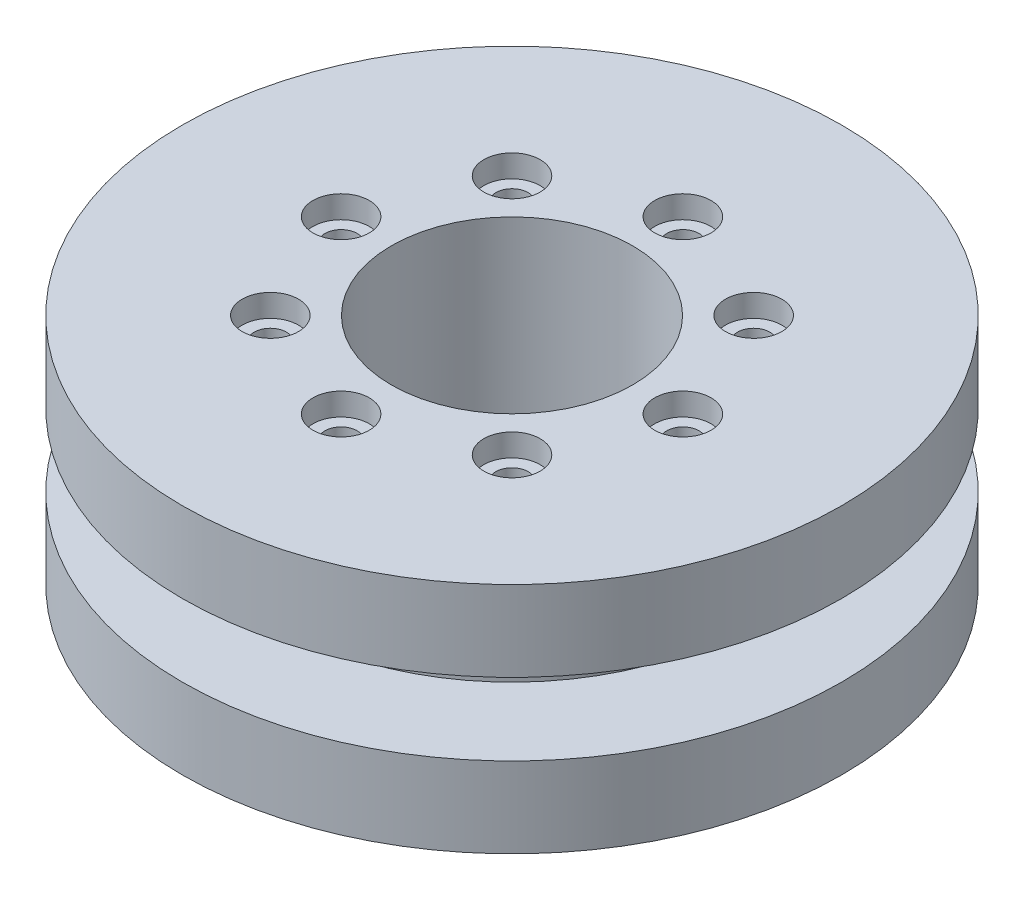
ISO-10303-21;
HEADER;
FILE_DESCRIPTION(('STEP AP214'),'2;1');
FILE_NAME('part.step','',(''),(''),'','','');
FILE_SCHEMA(('AUTOMOTIVE_DESIGN { 1 0 10303 214 1 1 1 1 }'));
ENDSEC;
DATA;
#1=APPLICATION_CONTEXT('core data for automotive mechanical design processes');
#2=APPLICATION_PROTOCOL_DEFINITION('international standard','automotive_design',2000,#1);
#3=PRODUCT_CONTEXT('',#1,'mechanical');
#4=PRODUCT('Part','Part','',(#3));
#5=PRODUCT_RELATED_PRODUCT_CATEGORY('part','',(#4));
#6=PRODUCT_DEFINITION_FORMATION('','',#4);
#7=PRODUCT_DEFINITION_CONTEXT('part definition',#1,'design');
#8=PRODUCT_DEFINITION('design','',#6,#7);
#9=PRODUCT_DEFINITION_SHAPE('','',#8);
#10=(LENGTH_UNIT() NAMED_UNIT(*) SI_UNIT(.MILLI.,.METRE.));
#11=(NAMED_UNIT(*) PLANE_ANGLE_UNIT() SI_UNIT($,.RADIAN.));
#12=(NAMED_UNIT(*) SI_UNIT($,.STERADIAN.) SOLID_ANGLE_UNIT());
#13=UNCERTAINTY_MEASURE_WITH_UNIT(LENGTH_MEASURE(1.E-05),#10,'distance_accuracy_value','');
#14=(GEOMETRIC_REPRESENTATION_CONTEXT(3) GLOBAL_UNCERTAINTY_ASSIGNED_CONTEXT((#13)) GLOBAL_UNIT_ASSIGNED_CONTEXT((#10,
#11,#12)) REPRESENTATION_CONTEXT('',''));
#15=CARTESIAN_POINT('',(0.,0.,0.));
#16=DIRECTION('',(0.,0.,1.));
#17=DIRECTION('',(1.,0.,0.));
#18=AXIS2_PLACEMENT_3D('',#15,#16,#17);
#19=CARTESIAN_POINT('',(0.,14.5,0.));
#20=DIRECTION('',(0.,-1.,0.));
#21=DIRECTION('',(0.,0.,-1.));
#22=AXIS2_PLACEMENT_3D('',#19,#20,#21);
#23=CYLINDRICAL_SURFACE('',#22,41.);
#24=CARTESIAN_POINT('',(0.,14.5,0.));
#25=DIRECTION('',(0.,1.,0.));
#26=DIRECTION('',(0.,0.,1.));
#27=AXIS2_PLACEMENT_3D('',#24,#25,#26);
#28=CIRCLE('',#27,41.);
#29=CARTESIAN_POINT('',(0.,14.5,41.));
#30=VERTEX_POINT('',#29);
#31=EDGE_CURVE('E10',#30,#30,#28,.T.);
#32=ORIENTED_EDGE('',*,*,#31,.F.);
#33=EDGE_LOOP('',(#32));
#34=FACE_BOUND('',#33,.T.);
#35=CARTESIAN_POINT('',(0.,4.5,0.));
#36=DIRECTION('',(0.,1.,0.));
#37=DIRECTION('',(0.,0.,1.));
#38=AXIS2_PLACEMENT_3D('',#35,#36,#37);
#39=CIRCLE('',#38,41.);
#40=CARTESIAN_POINT('',(0.,4.5,41.));
#41=VERTEX_POINT('',#40);
#42=EDGE_CURVE('E59',#41,#41,#39,.T.);
#43=ORIENTED_EDGE('',*,*,#42,.T.);
#44=EDGE_LOOP('',(#43));
#45=FACE_BOUND('',#44,.T.);
#46=ADVANCED_FACE('F32',(#34,#45),#23,.T.);
#47=CARTESIAN_POINT('',(0.,14.5,0.));
#48=DIRECTION('',(0.,1.,0.));
#49=DIRECTION('',(0.,0.,1.));
#50=AXIS2_PLACEMENT_3D('',#47,#48,#49);
#51=PLANE('',#50);
#52=CARTESIAN_POINT('',(-15.026019100214,14.5,-15.0260191002143));
#53=DIRECTION('',(0.,1.,0.));
#54=DIRECTION('',(0.,0.,1.));
#55=AXIS2_PLACEMENT_3D('',#52,#53,#54);
#56=CIRCLE('',#55,3.50000000000001);
#57=CARTESIAN_POINT('',(-15.026019100214,14.5,-11.5260191002143));
#58=VERTEX_POINT('',#57);
#59=EDGE_CURVE('E155',#58,#58,#56,.T.);
#60=ORIENTED_EDGE('',*,*,#59,.F.);
#61=EDGE_LOOP('',(#60));
#62=FACE_BOUND('',#61,.T.);
#63=CARTESIAN_POINT('',(-21.25,14.5,-2.2258193535125E-13));
#64=DIRECTION('',(0.,1.,0.));
#65=DIRECTION('',(0.,0.,1.));
#66=AXIS2_PLACEMENT_3D('',#63,#64,#65);
#67=CIRCLE('',#66,3.50000000000001);
#68=CARTESIAN_POINT('',(-21.25,14.5,3.49999999999979));
#69=VERTEX_POINT('',#68);
#70=EDGE_CURVE('E143',#69,#69,#67,.T.);
#71=ORIENTED_EDGE('',*,*,#70,.F.);
#72=EDGE_LOOP('',(#71));
#73=FACE_BOUND('',#72,.T.);
#74=CARTESIAN_POINT('',(-15.0260191002143,14.5,15.026019100214));
#75=DIRECTION('',(0.,1.,0.));
#76=DIRECTION('',(0.,0.,1.));
#77=AXIS2_PLACEMENT_3D('',#74,#75,#76);
#78=CIRCLE('',#77,3.50000000000001);
#79=CARTESIAN_POINT('',(-15.0260191002143,14.5,18.526019100214));
#80=VERTEX_POINT('',#79);
#81=EDGE_CURVE('E131',#80,#80,#78,.T.);
#82=ORIENTED_EDGE('',*,*,#81,.F.);
#83=EDGE_LOOP('',(#82));
#84=FACE_BOUND('',#83,.T.);
#85=CARTESIAN_POINT('',(0.,14.5,21.25));
#86=DIRECTION('',(0.,1.,0.));
#87=DIRECTION('',(0.,0.,1.));
#88=AXIS2_PLACEMENT_3D('',#85,#86,#87);
#89=CIRCLE('',#88,3.50000000000001);
#90=CARTESIAN_POINT('',(0.,14.5,24.75));
#91=VERTEX_POINT('',#90);
#92=EDGE_CURVE('E119',#91,#91,#89,.T.);
#93=ORIENTED_EDGE('',*,*,#92,.F.);
#94=EDGE_LOOP('',(#93));
#95=FACE_BOUND('',#94,.T.);
#96=CARTESIAN_POINT('',(15.0260191002141,14.5,15.0260191002142));
#97=DIRECTION('',(0.,1.,0.));
#98=DIRECTION('',(0.,0.,1.));
#99=AXIS2_PLACEMENT_3D('',#96,#97,#98);
#100=CIRCLE('',#99,3.50000000000001);
#101=CARTESIAN_POINT('',(15.0260191002141,14.5,18.5260191002142));
#102=VERTEX_POINT('',#101);
#103=EDGE_CURVE('E107',#102,#102,#100,.T.);
#104=ORIENTED_EDGE('',*,*,#103,.F.);
#105=EDGE_LOOP('',(#104));
#106=FACE_BOUND('',#105,.T.);
#107=CARTESIAN_POINT('',(21.25,14.5,0.));
#108=DIRECTION('',(0.,1.,0.));
#109=DIRECTION('',(0.,0.,1.));
#110=AXIS2_PLACEMENT_3D('',#107,#108,#109);
#111=CIRCLE('',#110,3.50000000000001);
#112=CARTESIAN_POINT('',(21.25,14.5,3.50000000000009));
#113=VERTEX_POINT('',#112);
#114=EDGE_CURVE('E95',#113,#113,#111,.T.);
#115=ORIENTED_EDGE('',*,*,#114,.F.);
#116=EDGE_LOOP('',(#115));
#117=FACE_BOUND('',#116,.T.);
#118=CARTESIAN_POINT('',(15.0260191002142,14.5,-15.0260191002141));
#119=DIRECTION('',(0.,1.,0.));
#120=DIRECTION('',(0.,0.,1.));
#121=AXIS2_PLACEMENT_3D('',#118,#119,#120);
#122=CIRCLE('',#121,3.50000000000001);
#123=CARTESIAN_POINT('',(15.0260191002142,14.5,-11.5260191002141));
#124=VERTEX_POINT('',#123);
#125=EDGE_CURVE('E83',#124,#124,#122,.T.);
#126=ORIENTED_EDGE('',*,*,#125,.F.);
#127=EDGE_LOOP('',(#126));
#128=FACE_BOUND('',#127,.T.);
#129=CARTESIAN_POINT('',(0.,14.5,-21.25));
#130=DIRECTION('',(0.,1.,0.));
#131=DIRECTION('',(0.,0.,1.));
#132=AXIS2_PLACEMENT_3D('',#129,#130,#131);
#133=CIRCLE('',#132,3.50000000000001);
#134=CARTESIAN_POINT('',(0.,14.5,-17.75));
#135=VERTEX_POINT('',#134);
#136=EDGE_CURVE('E71',#135,#135,#133,.T.);
#137=ORIENTED_EDGE('',*,*,#136,.F.);
#138=EDGE_LOOP('',(#137));
#139=FACE_BOUND('',#138,.T.);
#140=ORIENTED_EDGE('',*,*,#31,.T.);
#141=EDGE_LOOP('',(#140));
#142=FACE_BOUND('',#141,.T.);
#143=CARTESIAN_POINT('',(0.,14.5,0.));
#144=DIRECTION('',(0.,1.,0.));
#145=DIRECTION('',(0.,0.,1.));
#146=AXIS2_PLACEMENT_3D('',#143,#144,#145);
#147=CIRCLE('',#146,15.);
#148=CARTESIAN_POINT('',(0.,14.5,15.));
#149=VERTEX_POINT('',#148);
#150=EDGE_CURVE('E43',#149,#149,#147,.T.);
#151=ORIENTED_EDGE('',*,*,#150,.F.);
#152=EDGE_LOOP('',(#151));
#153=FACE_BOUND('',#152,.T.);
#154=ADVANCED_FACE('F161',(#62,#73,#84,#95,#106,#117,#128,#139,#142,#153),#51,.T.);
#155=CARTESIAN_POINT('',(0.,-14.5,0.));
#156=DIRECTION('',(0.,1.,0.));
#157=DIRECTION('',(0.,0.,1.));
#158=AXIS2_PLACEMENT_3D('',#155,#156,#157);
#159=PLANE('',#158);
#160=CARTESIAN_POINT('',(-15.026019100214,-14.5,-15.0260191002143));
#161=DIRECTION('',(0.,1.,0.));
#162=DIRECTION('',(0.,0.,1.));
#163=AXIS2_PLACEMENT_3D('',#160,#161,#162);
#164=CIRCLE('',#163,2.00000000000001);
#165=CARTESIAN_POINT('',(-15.026019100214,-14.5,-13.0260191002143));
#166=VERTEX_POINT('',#165);
#167=EDGE_CURVE('E146',#166,#166,#164,.T.);
#168=ORIENTED_EDGE('',*,*,#167,.T.);
#169=EDGE_LOOP('',(#168));
#170=FACE_BOUND('',#169,.T.);
#171=CARTESIAN_POINT('',(-21.25,-14.5,-2.2258193535125E-13));
#172=DIRECTION('',(0.,1.,0.));
#173=DIRECTION('',(0.,0.,1.));
#174=AXIS2_PLACEMENT_3D('',#171,#172,#173);
#175=CIRCLE('',#174,2.00000000000001);
#176=CARTESIAN_POINT('',(-21.25,-14.5,1.99999999999979));
#177=VERTEX_POINT('',#176);
#178=EDGE_CURVE('E134',#177,#177,#175,.T.);
#179=ORIENTED_EDGE('',*,*,#178,.T.);
#180=EDGE_LOOP('',(#179));
#181=FACE_BOUND('',#180,.T.);
#182=CARTESIAN_POINT('',(-15.0260191002143,-14.5,15.026019100214));
#183=DIRECTION('',(0.,1.,0.));
#184=DIRECTION('',(0.,0.,1.));
#185=AXIS2_PLACEMENT_3D('',#182,#183,#184);
#186=CIRCLE('',#185,2.00000000000001);
#187=CARTESIAN_POINT('',(-15.0260191002143,-14.5,17.026019100214));
#188=VERTEX_POINT('',#187);
#189=EDGE_CURVE('E122',#188,#188,#186,.T.);
#190=ORIENTED_EDGE('',*,*,#189,.T.);
#191=EDGE_LOOP('',(#190));
#192=FACE_BOUND('',#191,.T.);
#193=CARTESIAN_POINT('',(0.,-14.5,21.25));
#194=DIRECTION('',(0.,1.,0.));
#195=DIRECTION('',(0.,0.,1.));
#196=AXIS2_PLACEMENT_3D('',#193,#194,#195);
#197=CIRCLE('',#196,2.00000000000001);
#198=CARTESIAN_POINT('',(0.,-14.5,23.25));
#199=VERTEX_POINT('',#198);
#200=EDGE_CURVE('E110',#199,#199,#197,.T.);
#201=ORIENTED_EDGE('',*,*,#200,.T.);
#202=EDGE_LOOP('',(#201));
#203=FACE_BOUND('',#202,.T.);
#204=CARTESIAN_POINT('',(15.0260191002141,-14.5,15.0260191002142));
#205=DIRECTION('',(0.,1.,0.));
#206=DIRECTION('',(0.,0.,1.));
#207=AXIS2_PLACEMENT_3D('',#204,#205,#206);
#208=CIRCLE('',#207,2.00000000000001);
#209=CARTESIAN_POINT('',(15.0260191002141,-14.5,17.0260191002142));
#210=VERTEX_POINT('',#209);
#211=EDGE_CURVE('E98',#210,#210,#208,.T.);
#212=ORIENTED_EDGE('',*,*,#211,.T.);
#213=EDGE_LOOP('',(#212));
#214=FACE_BOUND('',#213,.T.);
#215=CARTESIAN_POINT('',(21.25,-14.5,0.));
#216=DIRECTION('',(0.,1.,0.));
#217=DIRECTION('',(0.,0.,1.));
#218=AXIS2_PLACEMENT_3D('',#215,#216,#217);
#219=CIRCLE('',#218,2.00000000000001);
#220=CARTESIAN_POINT('',(21.25,-14.5,2.00000000000008));
#221=VERTEX_POINT('',#220);
#222=EDGE_CURVE('E86',#221,#221,#219,.T.);
#223=ORIENTED_EDGE('',*,*,#222,.T.);
#224=EDGE_LOOP('',(#223));
#225=FACE_BOUND('',#224,.T.);
#226=CARTESIAN_POINT('',(15.0260191002142,-14.5,-15.0260191002141));
#227=DIRECTION('',(0.,1.,0.));
#228=DIRECTION('',(0.,0.,1.));
#229=AXIS2_PLACEMENT_3D('',#226,#227,#228);
#230=CIRCLE('',#229,2.00000000000001);
#231=CARTESIAN_POINT('',(15.0260191002142,-14.5,-13.0260191002141));
#232=VERTEX_POINT('',#231);
#233=EDGE_CURVE('E74',#232,#232,#230,.T.);
#234=ORIENTED_EDGE('',*,*,#233,.T.);
#235=EDGE_LOOP('',(#234));
#236=FACE_BOUND('',#235,.T.);
#237=CARTESIAN_POINT('',(0.,-14.5,-21.25));
#238=DIRECTION('',(0.,1.,0.));
#239=DIRECTION('',(0.,0.,1.));
#240=AXIS2_PLACEMENT_3D('',#237,#238,#239);
#241=CIRCLE('',#240,2.00000000000001);
#242=CARTESIAN_POINT('',(0.,-14.5,-19.25));
#243=VERTEX_POINT('',#242);
#244=EDGE_CURVE('E62',#243,#243,#241,.T.);
#245=ORIENTED_EDGE('',*,*,#244,.T.);
#246=EDGE_LOOP('',(#245));
#247=FACE_BOUND('',#246,.T.);
#248=CARTESIAN_POINT('',(0.,-14.5,0.));
#249=DIRECTION('',(0.,1.,0.));
#250=DIRECTION('',(0.,0.,1.));
#251=AXIS2_PLACEMENT_3D('',#248,#249,#250);
#252=CIRCLE('',#251,41.);
#253=CARTESIAN_POINT('',(0.,-14.5,41.));
#254=VERTEX_POINT('',#253);
#255=EDGE_CURVE('E36',#254,#254,#252,.T.);
#256=ORIENTED_EDGE('',*,*,#255,.F.);
#257=EDGE_LOOP('',(#256));
#258=FACE_BOUND('',#257,.T.);
#259=CARTESIAN_POINT('',(0.,-14.5,0.));
#260=DIRECTION('',(0.,1.,0.));
#261=DIRECTION('',(0.,0.,1.));
#262=AXIS2_PLACEMENT_3D('',#259,#260,#261);
#263=CIRCLE('',#262,15.);
#264=CARTESIAN_POINT('',(0.,-14.5,15.));
#265=VERTEX_POINT('',#264);
#266=EDGE_CURVE('E45',#265,#265,#263,.T.);
#267=ORIENTED_EDGE('',*,*,#266,.T.);
#268=EDGE_LOOP('',(#267));
#269=FACE_BOUND('',#268,.T.);
#270=ADVANCED_FACE('F164',(#170,#181,#192,#203,#214,#225,#236,#247,#258,#269),#159,.F.);
#271=CARTESIAN_POINT('',(0.,-4.5,0.));
#272=DIRECTION('',(0.,1.,0.));
#273=DIRECTION('',(0.,0.,1.));
#274=AXIS2_PLACEMENT_3D('',#271,#272,#273);
#275=CIRCLE('',#274,41.);
#276=CARTESIAN_POINT('',(0.,-4.5,41.));
#277=VERTEX_POINT('',#276);
#278=EDGE_CURVE('E56',#277,#277,#275,.T.);
#279=ORIENTED_EDGE('',*,*,#278,.F.);
#280=EDGE_LOOP('',(#279));
#281=FACE_BOUND('',#280,.T.);
#282=ORIENTED_EDGE('',*,*,#255,.T.);
#283=EDGE_LOOP('',(#282));
#284=FACE_BOUND('',#283,.T.);
#285=ADVANCED_FACE('F34',(#281,#284),#23,.T.);
#286=CARTESIAN_POINT('',(0.,14.5,0.));
#287=DIRECTION('',(0.,-1.,0.));
#288=DIRECTION('',(0.,0.,-1.));
#289=AXIS2_PLACEMENT_3D('',#286,#287,#288);
#290=CYLINDRICAL_SURFACE('',#289,15.);
#291=ORIENTED_EDGE('',*,*,#150,.T.);
#292=EDGE_LOOP('',(#291));
#293=FACE_BOUND('',#292,.T.);
#294=ORIENTED_EDGE('',*,*,#266,.F.);
#295=EDGE_LOOP('',(#294));
#296=FACE_BOUND('',#295,.T.);
#297=ADVANCED_FACE('F182',(#293,#296),#290,.F.);
#298=CARTESIAN_POINT('',(0.,4.5,0.));
#299=DIRECTION('',(0.,-1.,0.));
#300=DIRECTION('',(0.,0.,-1.));
#301=AXIS2_PLACEMENT_3D('',#298,#299,#300);
#302=PLANE('',#301);
#303=CARTESIAN_POINT('',(0.,4.5,0.));
#304=DIRECTION('',(0.,1.,0.));
#305=DIRECTION('',(0.,0.,1.));
#306=AXIS2_PLACEMENT_3D('',#303,#304,#305);
#307=CIRCLE('',#306,29.);
#308=CARTESIAN_POINT('',(0.,4.5,29.));
#309=VERTEX_POINT('',#308);
#310=EDGE_CURVE('E48',#309,#309,#307,.T.);
#311=ORIENTED_EDGE('',*,*,#310,.T.);
#312=EDGE_LOOP('',(#311));
#313=FACE_BOUND('',#312,.T.);
#314=ORIENTED_EDGE('',*,*,#42,.F.);
#315=EDGE_LOOP('',(#314));
#316=FACE_BOUND('',#315,.T.);
#317=ADVANCED_FACE('F185',(#313,#316),#302,.T.);
#318=CARTESIAN_POINT('',(0.,14.5,0.));
#319=DIRECTION('',(0.,1.,0.));
#320=DIRECTION('',(0.,0.,1.));
#321=AXIS2_PLACEMENT_3D('',#318,#319,#320);
#322=CYLINDRICAL_SURFACE('',#321,29.);
#323=CARTESIAN_POINT('',(0.,-4.5,0.));
#324=DIRECTION('',(0.,1.,0.));
#325=DIRECTION('',(0.,0.,1.));
#326=AXIS2_PLACEMENT_3D('',#323,#324,#325);
#327=CIRCLE('',#326,29.);
#328=CARTESIAN_POINT('',(0.,-4.5,29.));
#329=VERTEX_POINT('',#328);
#330=EDGE_CURVE('E53',#329,#329,#327,.T.);
#331=ORIENTED_EDGE('',*,*,#330,.T.);
#332=EDGE_LOOP('',(#331));
#333=FACE_BOUND('',#332,.T.);
#334=ORIENTED_EDGE('',*,*,#310,.F.);
#335=EDGE_LOOP('',(#334));
#336=FACE_BOUND('',#335,.T.);
#337=ADVANCED_FACE('F204',(#333,#336),#322,.T.);
#338=CARTESIAN_POINT('',(0.,-4.5,0.));
#339=DIRECTION('',(0.,-1.,0.));
#340=DIRECTION('',(0.,0.,-1.));
#341=AXIS2_PLACEMENT_3D('',#338,#339,#340);
#342=PLANE('',#341);
#343=ORIENTED_EDGE('',*,*,#330,.F.);
#344=EDGE_LOOP('',(#343));
#345=FACE_BOUND('',#344,.T.);
#346=ORIENTED_EDGE('',*,*,#278,.T.);
#347=EDGE_LOOP('',(#346));
#348=FACE_BOUND('',#347,.T.);
#349=ADVANCED_FACE('F210',(#345,#348),#342,.F.);
#350=CARTESIAN_POINT('',(0.,14.5,-21.25));
#351=DIRECTION('',(0.,1.,0.));
#352=DIRECTION('',(0.,0.,1.));
#353=AXIS2_PLACEMENT_3D('',#350,#351,#352);
#354=CYLINDRICAL_SURFACE('',#353,2.00000000000001);
#355=ORIENTED_EDGE('',*,*,#244,.F.);
#356=EDGE_LOOP('',(#355));
#357=FACE_BOUND('',#356,.T.);
#358=CARTESIAN_POINT('',(0.,11.7,-21.25));
#359=DIRECTION('',(0.,1.,0.));
#360=DIRECTION('',(0.,0.,1.));
#361=AXIS2_PLACEMENT_3D('',#358,#359,#360);
#362=CIRCLE('',#361,2.00000000000001);
#363=CARTESIAN_POINT('',(0.,11.7,-19.25));
#364=VERTEX_POINT('',#363);
#365=EDGE_CURVE('E65',#364,#364,#362,.T.);
#366=ORIENTED_EDGE('',*,*,#365,.T.);
#367=EDGE_LOOP('',(#366));
#368=FACE_BOUND('',#367,.T.);
#369=ADVANCED_FACE('F216',(#357,#368),#354,.F.);
#370=CARTESIAN_POINT('',(2.00000000000001,11.7,-21.25));
#371=DIRECTION('',(0.,-1.,0.));
#372=DIRECTION('',(0.,0.,-1.));
#373=AXIS2_PLACEMENT_3D('',#370,#371,#372);
#374=PLANE('',#373);
#375=ORIENTED_EDGE('',*,*,#365,.F.);
#376=EDGE_LOOP('',(#375));
#377=FACE_BOUND('',#376,.T.);
#378=CARTESIAN_POINT('',(0.,11.7,-21.25));
#379=DIRECTION('',(0.,1.,0.));
#380=DIRECTION('',(0.,0.,1.));
#381=AXIS2_PLACEMENT_3D('',#378,#379,#380);
#382=CIRCLE('',#381,3.50000000000001);
#383=CARTESIAN_POINT('',(0.,11.7,-17.75));
#384=VERTEX_POINT('',#383);
#385=EDGE_CURVE('E68',#384,#384,#382,.T.);
#386=ORIENTED_EDGE('',*,*,#385,.T.);
#387=EDGE_LOOP('',(#386));
#388=FACE_BOUND('',#387,.T.);
#389=ADVANCED_FACE('F220',(#377,#388),#374,.F.);
#390=CARTESIAN_POINT('',(0.,14.5,-21.25));
#391=DIRECTION('',(0.,1.,0.));
#392=DIRECTION('',(0.,0.,1.));
#393=AXIS2_PLACEMENT_3D('',#390,#391,#392);
#394=CYLINDRICAL_SURFACE('',#393,3.50000000000001);
#395=ORIENTED_EDGE('',*,*,#385,.F.);
#396=EDGE_LOOP('',(#395));
#397=FACE_BOUND('',#396,.T.);
#398=ORIENTED_EDGE('',*,*,#136,.T.);
#399=EDGE_LOOP('',(#398));
#400=FACE_BOUND('',#399,.T.);
#401=ADVANCED_FACE('F224',(#397,#400),#394,.F.);
#402=CARTESIAN_POINT('',(15.0260191002142,14.5,-15.0260191002141));
#403=DIRECTION('',(0.,1.,0.));
#404=DIRECTION('',(0.,0.,1.));
#405=AXIS2_PLACEMENT_3D('',#402,#403,#404);
#406=CYLINDRICAL_SURFACE('',#405,2.00000000000001);
#407=ORIENTED_EDGE('',*,*,#233,.F.);
#408=EDGE_LOOP('',(#407));
#409=FACE_BOUND('',#408,.T.);
#410=CARTESIAN_POINT('',(15.0260191002142,11.7,-15.0260191002141));
#411=DIRECTION('',(0.,1.,0.));
#412=DIRECTION('',(0.,0.,1.));
#413=AXIS2_PLACEMENT_3D('',#410,#411,#412);
#414=CIRCLE('',#413,2.00000000000001);
#415=CARTESIAN_POINT('',(15.0260191002142,11.7,-13.0260191002141));
#416=VERTEX_POINT('',#415);
#417=EDGE_CURVE('E77',#416,#416,#414,.T.);
#418=ORIENTED_EDGE('',*,*,#417,.T.);
#419=EDGE_LOOP('',(#418));
#420=FACE_BOUND('',#419,.T.);
#421=ADVANCED_FACE('F228',(#409,#420),#406,.F.);
#422=CARTESIAN_POINT('',(17.0260191002142,11.7,-15.0260191002141));
#423=DIRECTION('',(0.,-1.,0.));
#424=DIRECTION('',(0.,0.,-1.));
#425=AXIS2_PLACEMENT_3D('',#422,#423,#424);
#426=PLANE('',#425);
#427=ORIENTED_EDGE('',*,*,#417,.F.);
#428=EDGE_LOOP('',(#427));
#429=FACE_BOUND('',#428,.T.);
#430=CARTESIAN_POINT('',(15.0260191002142,11.7,-15.0260191002141));
#431=DIRECTION('',(0.,1.,0.));
#432=DIRECTION('',(0.,0.,1.));
#433=AXIS2_PLACEMENT_3D('',#430,#431,#432);
#434=CIRCLE('',#433,3.50000000000001);
#435=CARTESIAN_POINT('',(15.0260191002142,11.7,-11.5260191002141));
#436=VERTEX_POINT('',#435);
#437=EDGE_CURVE('E80',#436,#436,#434,.T.);
#438=ORIENTED_EDGE('',*,*,#437,.T.);
#439=EDGE_LOOP('',(#438));
#440=FACE_BOUND('',#439,.T.);
#441=ADVANCED_FACE('F232',(#429,#440),#426,.F.);
#442=CARTESIAN_POINT('',(15.0260191002142,14.5,-15.0260191002141));
#443=DIRECTION('',(0.,1.,0.));
#444=DIRECTION('',(0.,0.,1.));
#445=AXIS2_PLACEMENT_3D('',#442,#443,#444);
#446=CYLINDRICAL_SURFACE('',#445,3.50000000000001);
#447=ORIENTED_EDGE('',*,*,#437,.F.);
#448=EDGE_LOOP('',(#447));
#449=FACE_BOUND('',#448,.T.);
#450=ORIENTED_EDGE('',*,*,#125,.T.);
#451=EDGE_LOOP('',(#450));
#452=FACE_BOUND('',#451,.T.);
#453=ADVANCED_FACE('F236',(#449,#452),#446,.F.);
#454=CARTESIAN_POINT('',(21.25,14.5,0.));
#455=DIRECTION('',(0.,1.,0.));
#456=DIRECTION('',(0.,0.,1.));
#457=AXIS2_PLACEMENT_3D('',#454,#455,#456);
#458=CYLINDRICAL_SURFACE('',#457,2.00000000000001);
#459=ORIENTED_EDGE('',*,*,#222,.F.);
#460=EDGE_LOOP('',(#459));
#461=FACE_BOUND('',#460,.T.);
#462=CARTESIAN_POINT('',(21.25,11.7,0.));
#463=DIRECTION('',(0.,1.,0.));
#464=DIRECTION('',(0.,0.,1.));
#465=AXIS2_PLACEMENT_3D('',#462,#463,#464);
#466=CIRCLE('',#465,2.00000000000001);
#467=CARTESIAN_POINT('',(21.25,11.7,2.00000000000009));
#468=VERTEX_POINT('',#467);
#469=EDGE_CURVE('E89',#468,#468,#466,.T.);
#470=ORIENTED_EDGE('',*,*,#469,.T.);
#471=EDGE_LOOP('',(#470));
#472=FACE_BOUND('',#471,.T.);
#473=ADVANCED_FACE('F240',(#461,#472),#458,.F.);
#474=CARTESIAN_POINT('',(23.25,11.7,0.));
#475=DIRECTION('',(0.,-1.,0.));
#476=DIRECTION('',(0.,0.,-1.));
#477=AXIS2_PLACEMENT_3D('',#474,#475,#476);
#478=PLANE('',#477);
#479=ORIENTED_EDGE('',*,*,#469,.F.);
#480=EDGE_LOOP('',(#479));
#481=FACE_BOUND('',#480,.T.);
#482=CARTESIAN_POINT('',(21.25,11.7,0.));
#483=DIRECTION('',(0.,1.,0.));
#484=DIRECTION('',(0.,0.,1.));
#485=AXIS2_PLACEMENT_3D('',#482,#483,#484);
#486=CIRCLE('',#485,3.50000000000001);
#487=CARTESIAN_POINT('',(21.25,11.7,3.50000000000009));
#488=VERTEX_POINT('',#487);
#489=EDGE_CURVE('E92',#488,#488,#486,.T.);
#490=ORIENTED_EDGE('',*,*,#489,.T.);
#491=EDGE_LOOP('',(#490));
#492=FACE_BOUND('',#491,.T.);
#493=ADVANCED_FACE('F244',(#481,#492),#478,.F.);
#494=CARTESIAN_POINT('',(21.25,14.5,0.));
#495=DIRECTION('',(0.,1.,0.));
#496=DIRECTION('',(0.,0.,1.));
#497=AXIS2_PLACEMENT_3D('',#494,#495,#496);
#498=CYLINDRICAL_SURFACE('',#497,3.50000000000001);
#499=ORIENTED_EDGE('',*,*,#489,.F.);
#500=EDGE_LOOP('',(#499));
#501=FACE_BOUND('',#500,.T.);
#502=ORIENTED_EDGE('',*,*,#114,.T.);
#503=EDGE_LOOP('',(#502));
#504=FACE_BOUND('',#503,.T.);
#505=ADVANCED_FACE('F248',(#501,#504),#498,.F.);
#506=CARTESIAN_POINT('',(15.0260191002141,14.5,15.0260191002142));
#507=DIRECTION('',(0.,1.,0.));
#508=DIRECTION('',(0.,0.,1.));
#509=AXIS2_PLACEMENT_3D('',#506,#507,#508);
#510=CYLINDRICAL_SURFACE('',#509,2.00000000000001);
#511=ORIENTED_EDGE('',*,*,#211,.F.);
#512=EDGE_LOOP('',(#511));
#513=FACE_BOUND('',#512,.T.);
#514=CARTESIAN_POINT('',(15.0260191002141,11.7,15.0260191002142));
#515=DIRECTION('',(0.,1.,0.));
#516=DIRECTION('',(0.,0.,1.));
#517=AXIS2_PLACEMENT_3D('',#514,#515,#516);
#518=CIRCLE('',#517,2.00000000000001);
#519=CARTESIAN_POINT('',(15.0260191002141,11.7,17.0260191002142));
#520=VERTEX_POINT('',#519);
#521=EDGE_CURVE('E101',#520,#520,#518,.T.);
#522=ORIENTED_EDGE('',*,*,#521,.T.);
#523=EDGE_LOOP('',(#522));
#524=FACE_BOUND('',#523,.T.);
#525=ADVANCED_FACE('F252',(#513,#524),#510,.F.);
#526=CARTESIAN_POINT('',(17.0260191002141,11.7,15.0260191002142));
#527=DIRECTION('',(0.,-1.,0.));
#528=DIRECTION('',(0.,0.,-1.));
#529=AXIS2_PLACEMENT_3D('',#526,#527,#528);
#530=PLANE('',#529);
#531=ORIENTED_EDGE('',*,*,#521,.F.);
#532=EDGE_LOOP('',(#531));
#533=FACE_BOUND('',#532,.T.);
#534=CARTESIAN_POINT('',(15.0260191002141,11.7,15.0260191002142));
#535=DIRECTION('',(0.,1.,0.));
#536=DIRECTION('',(0.,0.,1.));
#537=AXIS2_PLACEMENT_3D('',#534,#535,#536);
#538=CIRCLE('',#537,3.50000000000001);
#539=CARTESIAN_POINT('',(15.0260191002141,11.7,18.5260191002142));
#540=VERTEX_POINT('',#539);
#541=EDGE_CURVE('E104',#540,#540,#538,.T.);
#542=ORIENTED_EDGE('',*,*,#541,.T.);
#543=EDGE_LOOP('',(#542));
#544=FACE_BOUND('',#543,.T.);
#545=ADVANCED_FACE('F256',(#533,#544),#530,.F.);
#546=CARTESIAN_POINT('',(15.0260191002141,14.5,15.0260191002142));
#547=DIRECTION('',(0.,1.,0.));
#548=DIRECTION('',(0.,0.,1.));
#549=AXIS2_PLACEMENT_3D('',#546,#547,#548);
#550=CYLINDRICAL_SURFACE('',#549,3.50000000000001);
#551=ORIENTED_EDGE('',*,*,#541,.F.);
#552=EDGE_LOOP('',(#551));
#553=FACE_BOUND('',#552,.T.);
#554=ORIENTED_EDGE('',*,*,#103,.T.);
#555=EDGE_LOOP('',(#554));
#556=FACE_BOUND('',#555,.T.);
#557=ADVANCED_FACE('F260',(#553,#556),#550,.F.);
#558=CARTESIAN_POINT('',(0.,14.5,21.25));
#559=DIRECTION('',(0.,1.,0.));
#560=DIRECTION('',(0.,0.,1.));
#561=AXIS2_PLACEMENT_3D('',#558,#559,#560);
#562=CYLINDRICAL_SURFACE('',#561,2.00000000000001);
#563=ORIENTED_EDGE('',*,*,#200,.F.);
#564=EDGE_LOOP('',(#563));
#565=FACE_BOUND('',#564,.T.);
#566=CARTESIAN_POINT('',(0.,11.7,21.25));
#567=DIRECTION('',(0.,1.,0.));
#568=DIRECTION('',(0.,0.,1.));
#569=AXIS2_PLACEMENT_3D('',#566,#567,#568);
#570=CIRCLE('',#569,2.00000000000001);
#571=CARTESIAN_POINT('',(0.,11.7,23.25));
#572=VERTEX_POINT('',#571);
#573=EDGE_CURVE('E113',#572,#572,#570,.T.);
#574=ORIENTED_EDGE('',*,*,#573,.T.);
#575=EDGE_LOOP('',(#574));
#576=FACE_BOUND('',#575,.T.);
#577=ADVANCED_FACE('F264',(#565,#576),#562,.F.);
#578=CARTESIAN_POINT('',(2.00000000000001,11.7,21.25));
#579=DIRECTION('',(0.,-1.,0.));
#580=DIRECTION('',(0.,0.,-1.));
#581=AXIS2_PLACEMENT_3D('',#578,#579,#580);
#582=PLANE('',#581);
#583=ORIENTED_EDGE('',*,*,#573,.F.);
#584=EDGE_LOOP('',(#583));
#585=FACE_BOUND('',#584,.T.);
#586=CARTESIAN_POINT('',(0.,11.7,21.25));
#587=DIRECTION('',(0.,1.,0.));
#588=DIRECTION('',(0.,0.,1.));
#589=AXIS2_PLACEMENT_3D('',#586,#587,#588);
#590=CIRCLE('',#589,3.50000000000001);
#591=CARTESIAN_POINT('',(0.,11.7,24.75));
#592=VERTEX_POINT('',#591);
#593=EDGE_CURVE('E116',#592,#592,#590,.T.);
#594=ORIENTED_EDGE('',*,*,#593,.T.);
#595=EDGE_LOOP('',(#594));
#596=FACE_BOUND('',#595,.T.);
#597=ADVANCED_FACE('F268',(#585,#596),#582,.F.);
#598=CARTESIAN_POINT('',(0.,14.5,21.25));
#599=DIRECTION('',(0.,1.,0.));
#600=DIRECTION('',(0.,0.,1.));
#601=AXIS2_PLACEMENT_3D('',#598,#599,#600);
#602=CYLINDRICAL_SURFACE('',#601,3.50000000000001);
#603=ORIENTED_EDGE('',*,*,#593,.F.);
#604=EDGE_LOOP('',(#603));
#605=FACE_BOUND('',#604,.T.);
#606=ORIENTED_EDGE('',*,*,#92,.T.);
#607=EDGE_LOOP('',(#606));
#608=FACE_BOUND('',#607,.T.);
#609=ADVANCED_FACE('F272',(#605,#608),#602,.F.);
#610=CARTESIAN_POINT('',(-15.0260191002143,14.5,15.026019100214));
#611=DIRECTION('',(0.,1.,0.));
#612=DIRECTION('',(0.,0.,1.));
#613=AXIS2_PLACEMENT_3D('',#610,#611,#612);
#614=CYLINDRICAL_SURFACE('',#613,2.00000000000001);
#615=ORIENTED_EDGE('',*,*,#189,.F.);
#616=EDGE_LOOP('',(#615));
#617=FACE_BOUND('',#616,.T.);
#618=CARTESIAN_POINT('',(-15.0260191002143,11.7,15.026019100214));
#619=DIRECTION('',(0.,1.,0.));
#620=DIRECTION('',(0.,0.,1.));
#621=AXIS2_PLACEMENT_3D('',#618,#619,#620);
#622=CIRCLE('',#621,2.00000000000001);
#623=CARTESIAN_POINT('',(-15.0260191002143,11.7,17.026019100214));
#624=VERTEX_POINT('',#623);
#625=EDGE_CURVE('E125',#624,#624,#622,.T.);
#626=ORIENTED_EDGE('',*,*,#625,.T.);
#627=EDGE_LOOP('',(#626));
#628=FACE_BOUND('',#627,.T.);
#629=ADVANCED_FACE('F276',(#617,#628),#614,.F.);
#630=CARTESIAN_POINT('',(-13.0260191002143,11.7,15.026019100214));
#631=DIRECTION('',(0.,-1.,0.));
#632=DIRECTION('',(0.,0.,-1.));
#633=AXIS2_PLACEMENT_3D('',#630,#631,#632);
#634=PLANE('',#633);
#635=ORIENTED_EDGE('',*,*,#625,.F.);
#636=EDGE_LOOP('',(#635));
#637=FACE_BOUND('',#636,.T.);
#638=CARTESIAN_POINT('',(-15.0260191002143,11.7,15.026019100214));
#639=DIRECTION('',(0.,1.,0.));
#640=DIRECTION('',(0.,0.,1.));
#641=AXIS2_PLACEMENT_3D('',#638,#639,#640);
#642=CIRCLE('',#641,3.50000000000001);
#643=CARTESIAN_POINT('',(-15.0260191002143,11.7,18.526019100214));
#644=VERTEX_POINT('',#643);
#645=EDGE_CURVE('E128',#644,#644,#642,.T.);
#646=ORIENTED_EDGE('',*,*,#645,.T.);
#647=EDGE_LOOP('',(#646));
#648=FACE_BOUND('',#647,.T.);
#649=ADVANCED_FACE('F280',(#637,#648),#634,.F.);
#650=CARTESIAN_POINT('',(-15.0260191002143,14.5,15.026019100214));
#651=DIRECTION('',(0.,1.,0.));
#652=DIRECTION('',(0.,0.,1.));
#653=AXIS2_PLACEMENT_3D('',#650,#651,#652);
#654=CYLINDRICAL_SURFACE('',#653,3.50000000000001);
#655=ORIENTED_EDGE('',*,*,#645,.F.);
#656=EDGE_LOOP('',(#655));
#657=FACE_BOUND('',#656,.T.);
#658=ORIENTED_EDGE('',*,*,#81,.T.);
#659=EDGE_LOOP('',(#658));
#660=FACE_BOUND('',#659,.T.);
#661=ADVANCED_FACE('F284',(#657,#660),#654,.F.);
#662=CARTESIAN_POINT('',(-21.25,14.5,-2.2258193535125E-13));
#663=DIRECTION('',(0.,1.,0.));
#664=DIRECTION('',(0.,0.,1.));
#665=AXIS2_PLACEMENT_3D('',#662,#663,#664);
#666=CYLINDRICAL_SURFACE('',#665,2.00000000000001);
#667=ORIENTED_EDGE('',*,*,#178,.F.);
#668=EDGE_LOOP('',(#667));
#669=FACE_BOUND('',#668,.T.);
#670=CARTESIAN_POINT('',(-21.25,11.7,-2.2258193535125E-13));
#671=DIRECTION('',(0.,1.,0.));
#672=DIRECTION('',(0.,0.,1.));
#673=AXIS2_PLACEMENT_3D('',#670,#671,#672);
#674=CIRCLE('',#673,2.00000000000001);
#675=CARTESIAN_POINT('',(-21.25,11.7,1.99999999999979));
#676=VERTEX_POINT('',#675);
#677=EDGE_CURVE('E137',#676,#676,#674,.T.);
#678=ORIENTED_EDGE('',*,*,#677,.T.);
#679=EDGE_LOOP('',(#678));
#680=FACE_BOUND('',#679,.T.);
#681=ADVANCED_FACE('F288',(#669,#680),#666,.F.);
#682=CARTESIAN_POINT('',(-19.25,11.7,-2.2258193535125E-13));
#683=DIRECTION('',(0.,-1.,0.));
#684=DIRECTION('',(0.,0.,-1.));
#685=AXIS2_PLACEMENT_3D('',#682,#683,#684);
#686=PLANE('',#685);
#687=ORIENTED_EDGE('',*,*,#677,.F.);
#688=EDGE_LOOP('',(#687));
#689=FACE_BOUND('',#688,.T.);
#690=CARTESIAN_POINT('',(-21.25,11.7,-2.2258193535125E-13));
#691=DIRECTION('',(0.,1.,0.));
#692=DIRECTION('',(0.,0.,1.));
#693=AXIS2_PLACEMENT_3D('',#690,#691,#692);
#694=CIRCLE('',#693,3.50000000000001);
#695=CARTESIAN_POINT('',(-21.25,11.7,3.49999999999979));
#696=VERTEX_POINT('',#695);
#697=EDGE_CURVE('E140',#696,#696,#694,.T.);
#698=ORIENTED_EDGE('',*,*,#697,.T.);
#699=EDGE_LOOP('',(#698));
#700=FACE_BOUND('',#699,.T.);
#701=ADVANCED_FACE('F292',(#689,#700),#686,.F.);
#702=CARTESIAN_POINT('',(-21.25,14.5,-2.2258193535125E-13));
#703=DIRECTION('',(0.,1.,0.));
#704=DIRECTION('',(0.,0.,1.));
#705=AXIS2_PLACEMENT_3D('',#702,#703,#704);
#706=CYLINDRICAL_SURFACE('',#705,3.50000000000001);
#707=ORIENTED_EDGE('',*,*,#697,.F.);
#708=EDGE_LOOP('',(#707));
#709=FACE_BOUND('',#708,.T.);
#710=ORIENTED_EDGE('',*,*,#70,.T.);
#711=EDGE_LOOP('',(#710));
#712=FACE_BOUND('',#711,.T.);
#713=ADVANCED_FACE('F296',(#709,#712),#706,.F.);
#714=CARTESIAN_POINT('',(-15.026019100214,14.5,-15.0260191002143));
#715=DIRECTION('',(0.,1.,0.));
#716=DIRECTION('',(0.,0.,1.));
#717=AXIS2_PLACEMENT_3D('',#714,#715,#716);
#718=CYLINDRICAL_SURFACE('',#717,2.00000000000001);
#719=ORIENTED_EDGE('',*,*,#167,.F.);
#720=EDGE_LOOP('',(#719));
#721=FACE_BOUND('',#720,.T.);
#722=CARTESIAN_POINT('',(-15.026019100214,11.7,-15.0260191002143));
#723=DIRECTION('',(0.,1.,0.));
#724=DIRECTION('',(0.,0.,1.));
#725=AXIS2_PLACEMENT_3D('',#722,#723,#724);
#726=CIRCLE('',#725,2.00000000000001);
#727=CARTESIAN_POINT('',(-15.026019100214,11.7,-13.0260191002143));
#728=VERTEX_POINT('',#727);
#729=EDGE_CURVE('E149',#728,#728,#726,.T.);
#730=ORIENTED_EDGE('',*,*,#729,.T.);
#731=EDGE_LOOP('',(#730));
#732=FACE_BOUND('',#731,.T.);
#733=ADVANCED_FACE('F300',(#721,#732),#718,.F.);
#734=CARTESIAN_POINT('',(-13.0260191002139,11.7,-15.0260191002143));
#735=DIRECTION('',(0.,-1.,0.));
#736=DIRECTION('',(0.,0.,-1.));
#737=AXIS2_PLACEMENT_3D('',#734,#735,#736);
#738=PLANE('',#737);
#739=ORIENTED_EDGE('',*,*,#729,.F.);
#740=EDGE_LOOP('',(#739));
#741=FACE_BOUND('',#740,.T.);
#742=CARTESIAN_POINT('',(-15.026019100214,11.7,-15.0260191002143));
#743=DIRECTION('',(0.,1.,0.));
#744=DIRECTION('',(0.,0.,1.));
#745=AXIS2_PLACEMENT_3D('',#742,#743,#744);
#746=CIRCLE('',#745,3.50000000000001);
#747=CARTESIAN_POINT('',(-15.026019100214,11.7,-11.5260191002143));
#748=VERTEX_POINT('',#747);
#749=EDGE_CURVE('E152',#748,#748,#746,.T.);
#750=ORIENTED_EDGE('',*,*,#749,.T.);
#751=EDGE_LOOP('',(#750));
#752=FACE_BOUND('',#751,.T.);
#753=ADVANCED_FACE('F304',(#741,#752),#738,.F.);
#754=CARTESIAN_POINT('',(-15.026019100214,14.5,-15.0260191002143));
#755=DIRECTION('',(0.,1.,0.));
#756=DIRECTION('',(0.,0.,1.));
#757=AXIS2_PLACEMENT_3D('',#754,#755,#756);
#758=CYLINDRICAL_SURFACE('',#757,3.50000000000001);
#759=ORIENTED_EDGE('',*,*,#749,.F.);
#760=EDGE_LOOP('',(#759));
#761=FACE_BOUND('',#760,.T.);
#762=ORIENTED_EDGE('',*,*,#59,.T.);
#763=EDGE_LOOP('',(#762));
#764=FACE_BOUND('',#763,.T.);
#765=ADVANCED_FACE('F159',(#761,#764),#758,.F.);
#766=CLOSED_SHELL('',(#46,#154,#270,#285,#297,#317,#337,#349,#369,#389,#401,#421,#441,#453,#473,
#493,#505,#525,#545,#557,#577,#597,#609,#629,#649,#661,#681,#701,#713,#733,#753,#765));
#767=MANIFOLD_SOLID_BREP('B2',#766);
#768=ADVANCED_BREP_SHAPE_REPRESENTATION('',(#18,#767),#14);
#769=SHAPE_DEFINITION_REPRESENTATION(#9,#768);
ENDSEC;
END-ISO-10303-21;
